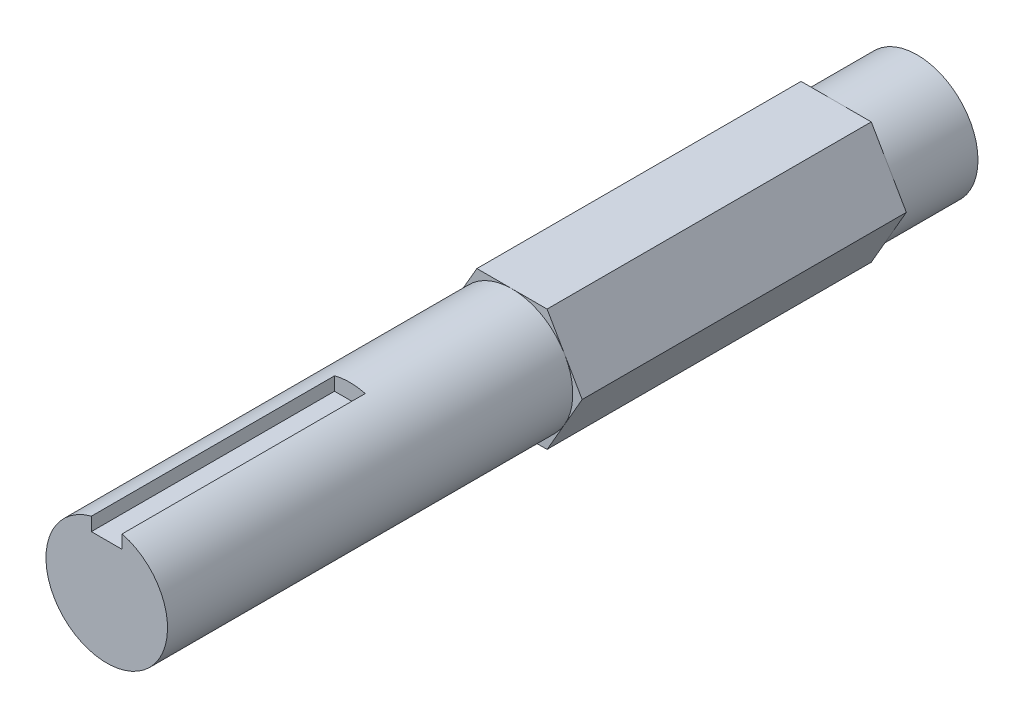
ISO-10303-21;
HEADER;
FILE_DESCRIPTION(('STEP AP214'),'2;1');
FILE_NAME('part.step','',(''),(''),'','','');
FILE_SCHEMA(('AUTOMOTIVE_DESIGN { 1 0 10303 214 1 1 1 1 }'));
ENDSEC;
DATA;
#1=APPLICATION_CONTEXT('core data for automotive mechanical design processes');
#2=APPLICATION_PROTOCOL_DEFINITION('international standard','automotive_design',2000,#1);
#3=PRODUCT_CONTEXT('',#1,'mechanical');
#4=PRODUCT('Part','Part','',(#3));
#5=PRODUCT_RELATED_PRODUCT_CATEGORY('part','',(#4));
#6=PRODUCT_DEFINITION_FORMATION('','',#4);
#7=PRODUCT_DEFINITION_CONTEXT('part definition',#1,'design');
#8=PRODUCT_DEFINITION('design','',#6,#7);
#9=PRODUCT_DEFINITION_SHAPE('','',#8);
#10=(LENGTH_UNIT() NAMED_UNIT(*) SI_UNIT(.MILLI.,.METRE.));
#11=(NAMED_UNIT(*) PLANE_ANGLE_UNIT() SI_UNIT($,.RADIAN.));
#12=(NAMED_UNIT(*) SI_UNIT($,.STERADIAN.) SOLID_ANGLE_UNIT());
#13=UNCERTAINTY_MEASURE_WITH_UNIT(LENGTH_MEASURE(1.E-05),#10,'distance_accuracy_value','');
#14=(GEOMETRIC_REPRESENTATION_CONTEXT(3) GLOBAL_UNCERTAINTY_ASSIGNED_CONTEXT((#13)) GLOBAL_UNIT_ASSIGNED_CONTEXT((#10,
#11,#12)) REPRESENTATION_CONTEXT('',''));
#15=CARTESIAN_POINT('',(0.,0.,0.));
#16=DIRECTION('',(0.,0.,1.));
#17=DIRECTION('',(1.,0.,0.));
#18=AXIS2_PLACEMENT_3D('',#15,#16,#17);
#19=CARTESIAN_POINT('',(-5.49926131403119,0.,63.5));
#20=DIRECTION('',(0.866025403784439,0.5,0.));
#21=DIRECTION('',(-0.5,0.866025403784439,0.));
#22=AXIS2_PLACEMENT_3D('',#19,#20,#21);
#23=PLANE('',#22);
#24=DIRECTION('',(-0.5,0.866025403784439,0.));
#25=VECTOR('',#24,1.);
#26=CARTESIAN_POINT('',(-5.49926131403119,0.,6.35));
#27=LINE('',#26,#25);
#28=CARTESIAN_POINT('',(-2.7496306570156,-4.7625,6.35));
#29=VERTEX_POINT('',#28);
#30=CARTESIAN_POINT('',(-4.12444598552339,-2.38125,6.35));
#31=VERTEX_POINT('',#30);
#32=EDGE_CURVE('E191',#29,#31,#27,.T.);
#33=ORIENTED_EDGE('',*,*,#32,.F.);
#34=DIRECTION('',(0.,0.,-1.));
#35=VECTOR('',#34,1.);
#36=CARTESIAN_POINT('',(-2.74963065701559,-4.7625,63.5));
#37=LINE('',#36,#35);
#38=CARTESIAN_POINT('',(-2.74963065701559,-4.7625,31.75));
#39=VERTEX_POINT('',#38);
#40=EDGE_CURVE('E236',#39,#29,#37,.T.);
#41=ORIENTED_EDGE('',*,*,#40,.F.);
#42=DIRECTION('',(0.5,-0.866025403784439,0.));
#43=VECTOR('',#42,1.);
#44=CARTESIAN_POINT('',(-5.49926131403119,0.,31.75));
#45=LINE('',#44,#43);
#46=CARTESIAN_POINT('',(-4.12444598552339,-2.38125,31.75));
#47=VERTEX_POINT('',#46);
#48=EDGE_CURVE('E218',#47,#39,#45,.T.);
#49=ORIENTED_EDGE('',*,*,#48,.F.);
#50=CARTESIAN_POINT('',(-5.49926131403119,0.,31.75));
#51=VERTEX_POINT('',#50);
#52=EDGE_CURVE('E220',#51,#47,#45,.T.);
#53=ORIENTED_EDGE('',*,*,#52,.F.);
#54=DIRECTION('',(0.,0.,-1.));
#55=VECTOR('',#54,1.);
#56=CARTESIAN_POINT('',(-5.49926131403119,0.,63.5));
#57=LINE('',#56,#55);
#58=CARTESIAN_POINT('',(-5.49926131403119,0.,6.35));
#59=VERTEX_POINT('',#58);
#60=EDGE_CURVE('E221',#51,#59,#57,.T.);
#61=ORIENTED_EDGE('',*,*,#60,.T.);
#62=EDGE_CURVE('E188',#31,#59,#27,.T.);
#63=ORIENTED_EDGE('',*,*,#62,.F.);
#64=EDGE_LOOP('',(#33,#41,#49,#53,#61,#63));
#65=FACE_BOUND('',#64,.T.);
#66=ADVANCED_FACE('F42',(#65),#23,.F.);
#67=CARTESIAN_POINT('',(-2.74963065701559,-4.7625,63.5));
#68=DIRECTION('',(0.,1.,0.));
#69=DIRECTION('',(-1.,0.,0.));
#70=AXIS2_PLACEMENT_3D('',#67,#68,#69);
#71=PLANE('',#70);
#72=DIRECTION('',(-1.,0.,0.));
#73=VECTOR('',#72,1.);
#74=CARTESIAN_POINT('',(-2.74963065701559,-4.7625,6.35));
#75=LINE('',#74,#73);
#76=CARTESIAN_POINT('',(2.74963065701559,-4.7625,6.35));
#77=VERTEX_POINT('',#76);
#78=CARTESIAN_POINT('',(0.,-4.7625,6.35));
#79=VERTEX_POINT('',#78);
#80=EDGE_CURVE('E197',#77,#79,#75,.T.);
#81=ORIENTED_EDGE('',*,*,#80,.F.);
#82=DIRECTION('',(0.,0.,-1.));
#83=VECTOR('',#82,1.);
#84=CARTESIAN_POINT('',(2.74963065701559,-4.7625,63.5));
#85=LINE('',#84,#83);
#86=CARTESIAN_POINT('',(2.74963065701559,-4.7625,31.75));
#87=VERTEX_POINT('',#86);
#88=EDGE_CURVE('E233',#87,#77,#85,.T.);
#89=ORIENTED_EDGE('',*,*,#88,.F.);
#90=DIRECTION('',(1.,0.,0.));
#91=VECTOR('',#90,1.);
#92=CARTESIAN_POINT('',(-2.74963065701559,-4.7625,31.75));
#93=LINE('',#92,#91);
#94=CARTESIAN_POINT('',(0.,-4.7625,31.75));
#95=VERTEX_POINT('',#94);
#96=EDGE_CURVE('E215',#95,#87,#93,.T.);
#97=ORIENTED_EDGE('',*,*,#96,.F.);
#98=EDGE_CURVE('E217',#39,#95,#93,.T.);
#99=ORIENTED_EDGE('',*,*,#98,.F.);
#100=ORIENTED_EDGE('',*,*,#40,.T.);
#101=EDGE_CURVE('E194',#79,#29,#75,.T.);
#102=ORIENTED_EDGE('',*,*,#101,.F.);
#103=EDGE_LOOP('',(#81,#89,#97,#99,#100,#102));
#104=FACE_BOUND('',#103,.T.);
#105=ADVANCED_FACE('F287',(#104),#71,.F.);
#106=CARTESIAN_POINT('',(2.74963065701559,-4.7625,63.5));
#107=DIRECTION('',(-0.866025403784439,0.5,0.));
#108=DIRECTION('',(-0.5,-0.866025403784439,0.));
#109=AXIS2_PLACEMENT_3D('',#106,#107,#108);
#110=PLANE('',#109);
#111=DIRECTION('',(-0.5,-0.866025403784439,0.));
#112=VECTOR('',#111,1.);
#113=CARTESIAN_POINT('',(2.74963065701559,-4.7625,6.35));
#114=LINE('',#113,#112);
#115=CARTESIAN_POINT('',(5.49926131403119,0.,6.35));
#116=VERTEX_POINT('',#115);
#117=CARTESIAN_POINT('',(4.12444598552339,-2.38125,6.35));
#118=VERTEX_POINT('',#117);
#119=EDGE_CURVE('E200',#116,#118,#114,.T.);
#120=ORIENTED_EDGE('',*,*,#119,.F.);
#121=DIRECTION('',(0.,0.,-1.));
#122=VECTOR('',#121,1.);
#123=CARTESIAN_POINT('',(5.49926131403119,0.,63.5));
#124=LINE('',#123,#122);
#125=CARTESIAN_POINT('',(5.49926131403119,0.,31.75));
#126=VERTEX_POINT('',#125);
#127=EDGE_CURVE('E230',#126,#116,#124,.T.);
#128=ORIENTED_EDGE('',*,*,#127,.F.);
#129=DIRECTION('',(0.5,0.866025403784439,0.));
#130=VECTOR('',#129,1.);
#131=CARTESIAN_POINT('',(2.74963065701559,-4.7625,31.75));
#132=LINE('',#131,#130);
#133=CARTESIAN_POINT('',(4.12444598552339,-2.38125,31.75));
#134=VERTEX_POINT('',#133);
#135=EDGE_CURVE('E212',#134,#126,#132,.T.);
#136=ORIENTED_EDGE('',*,*,#135,.F.);
#137=EDGE_CURVE('E214',#87,#134,#132,.T.);
#138=ORIENTED_EDGE('',*,*,#137,.F.);
#139=ORIENTED_EDGE('',*,*,#88,.T.);
#140=EDGE_CURVE('E198',#118,#77,#114,.T.);
#141=ORIENTED_EDGE('',*,*,#140,.F.);
#142=EDGE_LOOP('',(#120,#128,#136,#138,#139,#141));
#143=FACE_BOUND('',#142,.T.);
#144=ADVANCED_FACE('F340',(#143),#110,.F.);
#145=CARTESIAN_POINT('',(5.49926131403119,0.,63.5));
#146=DIRECTION('',(-0.866025403784439,-0.5,0.));
#147=DIRECTION('',(0.5,-0.866025403784439,0.));
#148=AXIS2_PLACEMENT_3D('',#145,#146,#147);
#149=PLANE('',#148);
#150=DIRECTION('',(0.5,-0.866025403784439,0.));
#151=VECTOR('',#150,1.);
#152=CARTESIAN_POINT('',(5.49926131403119,0.,6.35));
#153=LINE('',#152,#151);
#154=CARTESIAN_POINT('',(2.74963065701559,4.7625,6.35));
#155=VERTEX_POINT('',#154);
#156=CARTESIAN_POINT('',(4.12444598552339,2.38125,6.35));
#157=VERTEX_POINT('',#156);
#158=EDGE_CURVE('E192',#155,#157,#153,.T.);
#159=ORIENTED_EDGE('',*,*,#158,.F.);
#160=DIRECTION('',(0.,0.,-1.));
#161=VECTOR('',#160,1.);
#162=CARTESIAN_POINT('',(2.74963065701559,4.7625,63.5));
#163=LINE('',#162,#161);
#164=CARTESIAN_POINT('',(2.74963065701559,4.7625,31.75));
#165=VERTEX_POINT('',#164);
#166=EDGE_CURVE('E227',#165,#155,#163,.T.);
#167=ORIENTED_EDGE('',*,*,#166,.F.);
#168=DIRECTION('',(-0.5,0.866025403784439,0.));
#169=VECTOR('',#168,1.);
#170=CARTESIAN_POINT('',(5.49926131403119,0.,31.75));
#171=LINE('',#170,#169);
#172=CARTESIAN_POINT('',(4.12444598552339,2.38125,31.75));
#173=VERTEX_POINT('',#172);
#174=EDGE_CURVE('E209',#173,#165,#171,.T.);
#175=ORIENTED_EDGE('',*,*,#174,.F.);
#176=EDGE_CURVE('E211',#126,#173,#171,.T.);
#177=ORIENTED_EDGE('',*,*,#176,.F.);
#178=ORIENTED_EDGE('',*,*,#127,.T.);
#179=EDGE_CURVE('E195',#157,#116,#153,.T.);
#180=ORIENTED_EDGE('',*,*,#179,.F.);
#181=EDGE_LOOP('',(#159,#167,#175,#177,#178,#180));
#182=FACE_BOUND('',#181,.T.);
#183=ADVANCED_FACE('F321',(#182),#149,.F.);
#184=CARTESIAN_POINT('',(2.74963065701559,4.7625,63.5));
#185=DIRECTION('',(0.,-1.,0.));
#186=DIRECTION('',(1.,0.,0.));
#187=AXIS2_PLACEMENT_3D('',#184,#185,#186);
#188=PLANE('',#187);
#189=DIRECTION('',(1.,0.,0.));
#190=VECTOR('',#189,1.);
#191=CARTESIAN_POINT('',(2.74963065701559,4.7625,6.35));
#192=LINE('',#191,#190);
#193=CARTESIAN_POINT('',(-2.74963065701559,4.7625,6.35));
#194=VERTEX_POINT('',#193);
#195=CARTESIAN_POINT('',(0.,4.7625,6.35));
#196=VERTEX_POINT('',#195);
#197=EDGE_CURVE('E185',#194,#196,#192,.T.);
#198=ORIENTED_EDGE('',*,*,#197,.F.);
#199=DIRECTION('',(0.,0.,-1.));
#200=VECTOR('',#199,1.);
#201=CARTESIAN_POINT('',(-2.74963065701559,4.7625,63.5));
#202=LINE('',#201,#200);
#203=CARTESIAN_POINT('',(-2.74963065701559,4.7625,31.75));
#204=VERTEX_POINT('',#203);
#205=EDGE_CURVE('E224',#204,#194,#202,.T.);
#206=ORIENTED_EDGE('',*,*,#205,.F.);
#207=DIRECTION('',(-1.,0.,0.));
#208=VECTOR('',#207,1.);
#209=CARTESIAN_POINT('',(2.74963065701559,4.7625,31.75));
#210=LINE('',#209,#208);
#211=CARTESIAN_POINT('',(0.,4.7625,31.75));
#212=VERTEX_POINT('',#211);
#213=EDGE_CURVE('E204',#212,#204,#210,.T.);
#214=ORIENTED_EDGE('',*,*,#213,.F.);
#215=EDGE_CURVE('E208',#165,#212,#210,.T.);
#216=ORIENTED_EDGE('',*,*,#215,.F.);
#217=ORIENTED_EDGE('',*,*,#166,.T.);
#218=EDGE_CURVE('E189',#196,#155,#192,.T.);
#219=ORIENTED_EDGE('',*,*,#218,.F.);
#220=EDGE_LOOP('',(#198,#206,#214,#216,#217,#219));
#221=FACE_BOUND('',#220,.T.);
#222=ADVANCED_FACE('F268',(#221),#188,.F.);
#223=CARTESIAN_POINT('',(-2.74963065701559,4.7625,63.5));
#224=DIRECTION('',(0.866025403784439,-0.5,0.));
#225=DIRECTION('',(0.5,0.866025403784439,0.));
#226=AXIS2_PLACEMENT_3D('',#223,#224,#225);
#227=PLANE('',#226);
#228=DIRECTION('',(0.5,0.866025403784439,0.));
#229=VECTOR('',#228,1.);
#230=CARTESIAN_POINT('',(-2.74963065701559,4.7625,6.35));
#231=LINE('',#230,#229);
#232=CARTESIAN_POINT('',(-4.12444598552339,2.38125,6.35));
#233=VERTEX_POINT('',#232);
#234=EDGE_CURVE('E249',#59,#233,#231,.T.);
#235=ORIENTED_EDGE('',*,*,#234,.F.);
#236=ORIENTED_EDGE('',*,*,#60,.F.);
#237=DIRECTION('',(-0.5,-0.866025403784439,0.));
#238=VECTOR('',#237,1.);
#239=CARTESIAN_POINT('',(-2.74963065701559,4.7625,31.75));
#240=LINE('',#239,#238);
#241=CARTESIAN_POINT('',(-4.12444598552339,2.38125,31.75));
#242=VERTEX_POINT('',#241);
#243=EDGE_CURVE('E242',#242,#51,#240,.T.);
#244=ORIENTED_EDGE('',*,*,#243,.F.);
#245=EDGE_CURVE('E244',#204,#242,#240,.T.);
#246=ORIENTED_EDGE('',*,*,#245,.F.);
#247=ORIENTED_EDGE('',*,*,#205,.T.);
#248=EDGE_CURVE('E248',#233,#194,#231,.T.);
#249=ORIENTED_EDGE('',*,*,#248,.F.);
#250=EDGE_LOOP('',(#235,#236,#244,#246,#247,#249));
#251=FACE_BOUND('',#250,.T.);
#252=ADVANCED_FACE('F260',(#251),#227,.F.);
#253=CARTESIAN_POINT('',(0.,0.,31.75));
#254=DIRECTION('',(0.,0.,1.));
#255=DIRECTION('',(1.,0.,0.));
#256=AXIS2_PLACEMENT_3D('',#253,#254,#255);
#257=PLANE('',#256);
#258=ORIENTED_EDGE('',*,*,#52,.T.);
#259=CARTESIAN_POINT('',(0.,0.,31.75));
#260=DIRECTION('',(0.,0.,1.));
#261=DIRECTION('',(1.,0.,0.));
#262=AXIS2_PLACEMENT_3D('',#259,#260,#261);
#263=CIRCLE('',#262,4.7625);
#264=EDGE_CURVE('E308',#242,#47,#263,.T.);
#265=ORIENTED_EDGE('',*,*,#264,.F.);
#266=ORIENTED_EDGE('',*,*,#243,.T.);
#267=EDGE_LOOP('',(#258,#265,#266));
#268=FACE_BOUND('',#267,.T.);
#269=ADVANCED_FACE('F314',(#268),#257,.T.);
#270=ORIENTED_EDGE('',*,*,#48,.T.);
#271=ORIENTED_EDGE('',*,*,#98,.T.);
#272=EDGE_CURVE('E295',#47,#95,#263,.T.);
#273=ORIENTED_EDGE('',*,*,#272,.F.);
#274=EDGE_LOOP('',(#270,#271,#273));
#275=FACE_BOUND('',#274,.T.);
#276=ADVANCED_FACE('F293',(#275),#257,.T.);
#277=ORIENTED_EDGE('',*,*,#96,.T.);
#278=ORIENTED_EDGE('',*,*,#137,.T.);
#279=EDGE_CURVE('E299',#95,#134,#263,.T.);
#280=ORIENTED_EDGE('',*,*,#279,.F.);
#281=EDGE_LOOP('',(#277,#278,#280));
#282=FACE_BOUND('',#281,.T.);
#283=ADVANCED_FACE('F300',(#282),#257,.T.);
#284=ORIENTED_EDGE('',*,*,#135,.T.);
#285=ORIENTED_EDGE('',*,*,#176,.T.);
#286=EDGE_CURVE('E206',#134,#173,#263,.T.);
#287=ORIENTED_EDGE('',*,*,#286,.F.);
#288=EDGE_LOOP('',(#284,#285,#287));
#289=FACE_BOUND('',#288,.T.);
#290=ADVANCED_FACE('F343',(#289),#257,.T.);
#291=ORIENTED_EDGE('',*,*,#174,.T.);
#292=ORIENTED_EDGE('',*,*,#215,.T.);
#293=EDGE_CURVE('E201',#173,#212,#263,.T.);
#294=ORIENTED_EDGE('',*,*,#293,.F.);
#295=EDGE_LOOP('',(#291,#292,#294));
#296=FACE_BOUND('',#295,.T.);
#297=ADVANCED_FACE('F344',(#296),#257,.T.);
#298=ORIENTED_EDGE('',*,*,#213,.T.);
#299=ORIENTED_EDGE('',*,*,#245,.T.);
#300=EDGE_CURVE('E205',#212,#242,#263,.T.);
#301=ORIENTED_EDGE('',*,*,#300,.F.);
#302=EDGE_LOOP('',(#298,#299,#301));
#303=FACE_BOUND('',#302,.T.);
#304=ADVANCED_FACE('F317',(#303),#257,.T.);
#305=CARTESIAN_POINT('',(0.,0.,31.75));
#306=DIRECTION('',(0.,0.,1.));
#307=DIRECTION('',(1.,0.,0.));
#308=AXIS2_PLACEMENT_3D('',#305,#306,#307);
#309=CYLINDRICAL_SURFACE('',#308,4.7625);
#310=DIRECTION('',(0.,0.,1.));
#311=VECTOR('',#310,1.);
#312=CARTESIAN_POINT('',(1.20396,4.60780713229189,31.75));
#313=LINE('',#312,#311);
#314=CARTESIAN_POINT('',(1.20396,4.60780713229189,63.5));
#315=VERTEX_POINT('',#314);
#316=CARTESIAN_POINT('',(1.20396,4.60780713229189,44.45));
#317=VERTEX_POINT('',#316);
#318=EDGE_CURVE('E181',#315,#317,#313,.F.);
#319=ORIENTED_EDGE('',*,*,#318,.F.);
#320=CARTESIAN_POINT('',(0.,0.,63.5));
#321=DIRECTION('',(0.,0.,1.));
#322=DIRECTION('',(1.,0.,0.));
#323=AXIS2_PLACEMENT_3D('',#320,#321,#322);
#324=CIRCLE('',#323,4.7625);
#325=CARTESIAN_POINT('',(-1.20396,4.60780713229189,63.5));
#326=VERTEX_POINT('',#325);
#327=EDGE_CURVE('E239',#326,#315,#324,.T.);
#328=ORIENTED_EDGE('',*,*,#327,.F.);
#329=DIRECTION('',(0.,0.,1.));
#330=VECTOR('',#329,1.);
#331=CARTESIAN_POINT('',(-1.20396,4.60780713229189,31.75));
#332=LINE('',#331,#330);
#333=CARTESIAN_POINT('',(-1.20396,4.60780713229189,44.45));
#334=VERTEX_POINT('',#333);
#335=EDGE_CURVE('E56',#334,#326,#332,.T.);
#336=ORIENTED_EDGE('',*,*,#335,.F.);
#337=CARTESIAN_POINT('',(0.,0.,44.45));
#338=DIRECTION('',(0.,0.,1.));
#339=DIRECTION('',(1.,0.,0.));
#340=AXIS2_PLACEMENT_3D('',#337,#338,#339);
#341=CIRCLE('',#340,4.7625);
#342=EDGE_CURVE('E12',#334,#317,#341,.F.);
#343=ORIENTED_EDGE('',*,*,#342,.T.);
#344=EDGE_LOOP('',(#319,#328,#336,#343));
#345=FACE_BOUND('',#344,.T.);
#346=ORIENTED_EDGE('',*,*,#264,.T.);
#347=ORIENTED_EDGE('',*,*,#272,.T.);
#348=ORIENTED_EDGE('',*,*,#279,.T.);
#349=ORIENTED_EDGE('',*,*,#286,.T.);
#350=ORIENTED_EDGE('',*,*,#293,.T.);
#351=ORIENTED_EDGE('',*,*,#300,.T.);
#352=EDGE_LOOP('',(#346,#347,#348,#349,#350,#351));
#353=FACE_BOUND('',#352,.T.);
#354=ADVANCED_FACE('F306',(#345,#353),#309,.T.);
#355=CARTESIAN_POINT('',(0.,0.,63.5));
#356=DIRECTION('',(0.,0.,1.));
#357=DIRECTION('',(1.,0.,0.));
#358=AXIS2_PLACEMENT_3D('',#355,#356,#357);
#359=PLANE('',#358);
#360=DIRECTION('',(0.,1.,0.));
#361=VECTOR('',#360,1.);
#362=CARTESIAN_POINT('',(1.20396,5.96646,63.5));
#363=LINE('',#362,#361);
#364=CARTESIAN_POINT('',(1.20396,3.55854,63.5));
#365=VERTEX_POINT('',#364);
#366=EDGE_CURVE('E175',#365,#315,#363,.T.);
#367=ORIENTED_EDGE('',*,*,#366,.F.);
#368=DIRECTION('',(1.,0.,0.));
#369=VECTOR('',#368,1.);
#370=CARTESIAN_POINT('',(-1.20396,3.55854,63.5));
#371=LINE('',#370,#369);
#372=CARTESIAN_POINT('',(-1.20396,3.55854,63.5));
#373=VERTEX_POINT('',#372);
#374=EDGE_CURVE('E177',#373,#365,#371,.T.);
#375=ORIENTED_EDGE('',*,*,#374,.F.);
#376=DIRECTION('',(0.,-1.,0.));
#377=VECTOR('',#376,1.);
#378=CARTESIAN_POINT('',(-1.20396,0.,63.5));
#379=LINE('',#378,#377);
#380=EDGE_CURVE('E49',#326,#373,#379,.T.);
#381=ORIENTED_EDGE('',*,*,#380,.F.);
#382=ORIENTED_EDGE('',*,*,#327,.T.);
#383=EDGE_LOOP('',(#367,#375,#381,#382));
#384=FACE_BOUND('',#383,.T.);
#385=ADVANCED_FACE('F372',(#384),#359,.T.);
#386=CARTESIAN_POINT('',(0.,0.,6.35));
#387=DIRECTION('',(0.,0.,-1.));
#388=DIRECTION('',(-1.,0.,0.));
#389=AXIS2_PLACEMENT_3D('',#386,#387,#388);
#390=PLANE('',#389);
#391=ORIENTED_EDGE('',*,*,#119,.T.);
#392=CARTESIAN_POINT('',(0.,0.,6.35));
#393=DIRECTION('',(0.,0.,-1.));
#394=DIRECTION('',(-1.,0.,0.));
#395=AXIS2_PLACEMENT_3D('',#392,#393,#394);
#396=CIRCLE('',#395,4.7625);
#397=EDGE_CURVE('E329',#157,#118,#396,.T.);
#398=ORIENTED_EDGE('',*,*,#397,.F.);
#399=ORIENTED_EDGE('',*,*,#179,.T.);
#400=EDGE_LOOP('',(#391,#398,#399));
#401=FACE_BOUND('',#400,.T.);
#402=ADVANCED_FACE('F330',(#401),#390,.T.);
#403=ORIENTED_EDGE('',*,*,#140,.T.);
#404=ORIENTED_EDGE('',*,*,#80,.T.);
#405=EDGE_CURVE('E335',#118,#79,#396,.T.);
#406=ORIENTED_EDGE('',*,*,#405,.F.);
#407=EDGE_LOOP('',(#403,#404,#406));
#408=FACE_BOUND('',#407,.T.);
#409=ADVANCED_FACE('F338',(#408),#390,.T.);
#410=ORIENTED_EDGE('',*,*,#101,.T.);
#411=ORIENTED_EDGE('',*,*,#32,.T.);
#412=EDGE_CURVE('E278',#79,#31,#396,.T.);
#413=ORIENTED_EDGE('',*,*,#412,.F.);
#414=EDGE_LOOP('',(#410,#411,#413));
#415=FACE_BOUND('',#414,.T.);
#416=ADVANCED_FACE('F277',(#415),#390,.T.);
#417=ORIENTED_EDGE('',*,*,#158,.T.);
#418=EDGE_CURVE('E186',#196,#157,#396,.T.);
#419=ORIENTED_EDGE('',*,*,#418,.F.);
#420=ORIENTED_EDGE('',*,*,#218,.T.);
#421=EDGE_LOOP('',(#417,#419,#420));
#422=FACE_BOUND('',#421,.T.);
#423=ADVANCED_FACE('F325',(#422),#390,.T.);
#424=ORIENTED_EDGE('',*,*,#62,.T.);
#425=ORIENTED_EDGE('',*,*,#234,.T.);
#426=EDGE_CURVE('E183',#31,#233,#396,.T.);
#427=ORIENTED_EDGE('',*,*,#426,.F.);
#428=EDGE_LOOP('',(#424,#425,#427));
#429=FACE_BOUND('',#428,.T.);
#430=ADVANCED_FACE('F255',(#429),#390,.T.);
#431=ORIENTED_EDGE('',*,*,#197,.T.);
#432=EDGE_CURVE('E64',#233,#196,#396,.T.);
#433=ORIENTED_EDGE('',*,*,#432,.F.);
#434=ORIENTED_EDGE('',*,*,#248,.T.);
#435=EDGE_LOOP('',(#431,#433,#434));
#436=FACE_BOUND('',#435,.T.);
#437=ADVANCED_FACE('F264',(#436),#390,.T.);
#438=CARTESIAN_POINT('',(0.,0.,6.35));
#439=DIRECTION('',(0.,0.,-1.));
#440=DIRECTION('',(-1.,0.,0.));
#441=AXIS2_PLACEMENT_3D('',#438,#439,#440);
#442=CYLINDRICAL_SURFACE('',#441,4.7625);
#443=CARTESIAN_POINT('',(0.,0.,0.));
#444=DIRECTION('',(0.,0.,1.));
#445=DIRECTION('',(1.,0.,0.));
#446=AXIS2_PLACEMENT_3D('',#443,#444,#445);
#447=CIRCLE('',#446,4.7625);
#448=CARTESIAN_POINT('',(4.7625,0.,0.));
#449=VERTEX_POINT('',#448);
#450=EDGE_CURVE('E245',#449,#449,#447,.T.);
#451=ORIENTED_EDGE('',*,*,#450,.T.);
#452=EDGE_LOOP('',(#451));
#453=FACE_BOUND('',#452,.T.);
#454=ORIENTED_EDGE('',*,*,#412,.T.);
#455=ORIENTED_EDGE('',*,*,#426,.T.);
#456=ORIENTED_EDGE('',*,*,#432,.T.);
#457=ORIENTED_EDGE('',*,*,#418,.T.);
#458=ORIENTED_EDGE('',*,*,#397,.T.);
#459=ORIENTED_EDGE('',*,*,#405,.T.);
#460=EDGE_LOOP('',(#454,#455,#456,#457,#458,#459));
#461=FACE_BOUND('',#460,.T.);
#462=ADVANCED_FACE('F336',(#453,#461),#442,.T.);
#463=CARTESIAN_POINT('',(0.,0.,0.));
#464=DIRECTION('',(0.,0.,1.));
#465=DIRECTION('',(1.,0.,0.));
#466=AXIS2_PLACEMENT_3D('',#463,#464,#465);
#467=PLANE('',#466);
#468=ORIENTED_EDGE('',*,*,#450,.F.);
#469=EDGE_LOOP('',(#468));
#470=FACE_BOUND('',#469,.T.);
#471=ADVANCED_FACE('F368',(#470),#467,.F.);
#472=CARTESIAN_POINT('',(1.20396,5.96646,44.45));
#473=DIRECTION('',(1.,0.,0.));
#474=DIRECTION('',(0.,1.,0.));
#475=AXIS2_PLACEMENT_3D('',#472,#473,#474);
#476=PLANE('',#475);
#477=ORIENTED_EDGE('',*,*,#318,.T.);
#478=DIRECTION('',(0.,1.,0.));
#479=VECTOR('',#478,1.);
#480=CARTESIAN_POINT('',(1.20396,5.96646,44.45));
#481=LINE('',#480,#479);
#482=CARTESIAN_POINT('',(1.20396,3.55854,44.45));
#483=VERTEX_POINT('',#482);
#484=EDGE_CURVE('E160',#483,#317,#481,.T.);
#485=ORIENTED_EDGE('',*,*,#484,.F.);
#486=DIRECTION('',(0.,0.,1.));
#487=VECTOR('',#486,1.);
#488=CARTESIAN_POINT('',(1.20396,3.55854,44.45));
#489=LINE('',#488,#487);
#490=EDGE_CURVE('E168',#483,#365,#489,.T.);
#491=ORIENTED_EDGE('',*,*,#490,.T.);
#492=ORIENTED_EDGE('',*,*,#366,.T.);
#493=EDGE_LOOP('',(#477,#485,#491,#492));
#494=FACE_BOUND('',#493,.T.);
#495=ADVANCED_FACE('F370',(#494),#476,.F.);
#496=CARTESIAN_POINT('',(-1.20396,3.55854,44.45));
#497=DIRECTION('',(0.,-1.,0.));
#498=DIRECTION('',(0.,0.,-1.));
#499=AXIS2_PLACEMENT_3D('',#496,#497,#498);
#500=PLANE('',#499);
#501=ORIENTED_EDGE('',*,*,#374,.T.);
#502=ORIENTED_EDGE('',*,*,#490,.F.);
#503=DIRECTION('',(1.,0.,0.));
#504=VECTOR('',#503,1.);
#505=CARTESIAN_POINT('',(-1.20396,3.55854,44.45));
#506=LINE('',#505,#504);
#507=CARTESIAN_POINT('',(-1.20396,3.55854,44.45));
#508=VERTEX_POINT('',#507);
#509=EDGE_CURVE('E159',#508,#483,#506,.T.);
#510=ORIENTED_EDGE('',*,*,#509,.F.);
#511=DIRECTION('',(0.,0.,1.));
#512=VECTOR('',#511,1.);
#513=CARTESIAN_POINT('',(-1.20396,3.55854,44.45));
#514=LINE('',#513,#512);
#515=EDGE_CURVE('E163',#508,#373,#514,.T.);
#516=ORIENTED_EDGE('',*,*,#515,.T.);
#517=EDGE_LOOP('',(#501,#502,#510,#516));
#518=FACE_BOUND('',#517,.T.);
#519=ADVANCED_FACE('F170',(#518),#500,.F.);
#520=CARTESIAN_POINT('',(-1.20396,5.96646,44.45));
#521=DIRECTION('',(-1.,0.,0.));
#522=DIRECTION('',(0.,-1.,0.));
#523=AXIS2_PLACEMENT_3D('',#520,#521,#522);
#524=PLANE('',#523);
#525=ORIENTED_EDGE('',*,*,#335,.T.);
#526=ORIENTED_EDGE('',*,*,#380,.T.);
#527=ORIENTED_EDGE('',*,*,#515,.F.);
#528=DIRECTION('',(0.,-1.,0.));
#529=VECTOR('',#528,1.);
#530=CARTESIAN_POINT('',(-1.20396,5.96646,44.45));
#531=LINE('',#530,#529);
#532=EDGE_CURVE('E154',#334,#508,#531,.T.);
#533=ORIENTED_EDGE('',*,*,#532,.F.);
#534=EDGE_LOOP('',(#525,#526,#527,#533));
#535=FACE_BOUND('',#534,.T.);
#536=ADVANCED_FACE('F164',(#535),#524,.F.);
#537=CARTESIAN_POINT('',(0.,0.,44.45));
#538=DIRECTION('',(0.,0.,1.));
#539=DIRECTION('',(1.,0.,0.));
#540=AXIS2_PLACEMENT_3D('',#537,#538,#539);
#541=PLANE('',#540);
#542=ORIENTED_EDGE('',*,*,#532,.T.);
#543=ORIENTED_EDGE('',*,*,#509,.T.);
#544=ORIENTED_EDGE('',*,*,#484,.T.);
#545=ORIENTED_EDGE('',*,*,#342,.F.);
#546=EDGE_LOOP('',(#542,#543,#544,#545));
#547=FACE_BOUND('',#546,.T.);
#548=ADVANCED_FACE('F156',(#547),#541,.T.);
#549=CLOSED_SHELL('',(#66,#105,#144,#183,#222,#252,#269,#276,#283,#290,#297,#304,#354,#385,#402,
#409,#416,#423,#430,#437,#462,#471,#495,#519,#536,#548));
#550=MANIFOLD_SOLID_BREP('B2',#549);
#551=ADVANCED_BREP_SHAPE_REPRESENTATION('',(#18,#550),#14);
#552=SHAPE_DEFINITION_REPRESENTATION(#9,#551);
ENDSEC;
END-ISO-10303-21;
